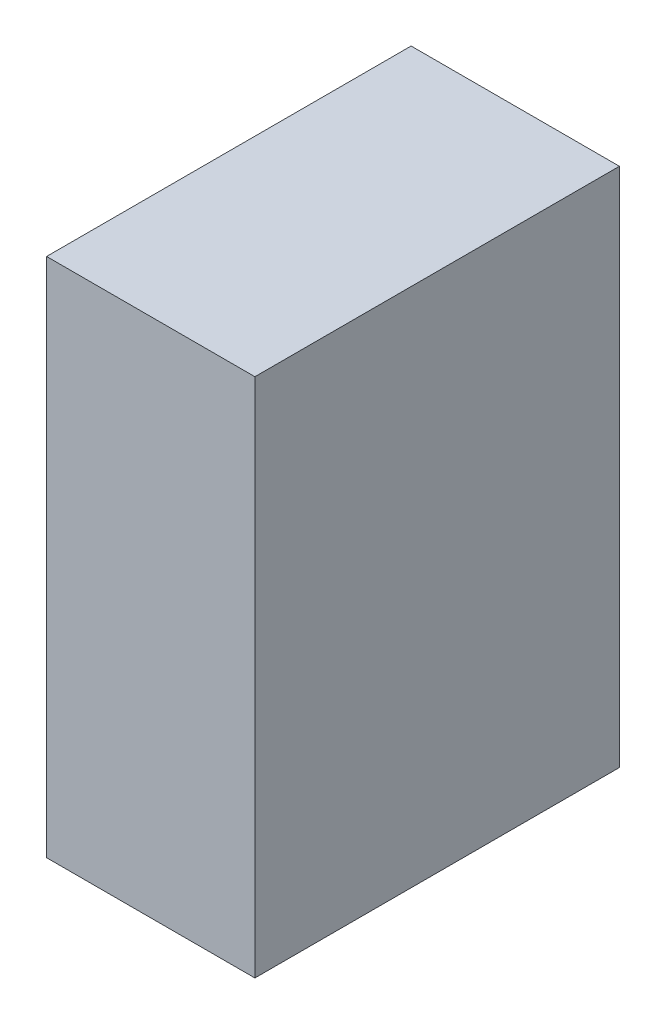
ISO-10303-21;
HEADER;
FILE_DESCRIPTION(('STEP AP214'),'2;1');
FILE_NAME('part.step','',(''),(''),'','','');
FILE_SCHEMA(('AUTOMOTIVE_DESIGN { 1 0 10303 214 1 1 1 1 }'));
ENDSEC;
DATA;
#1=APPLICATION_CONTEXT('core data for automotive mechanical design processes');
#2=APPLICATION_PROTOCOL_DEFINITION('international standard','automotive_design',2000,#1);
#3=PRODUCT_CONTEXT('',#1,'mechanical');
#4=PRODUCT('Part','Part','',(#3));
#5=PRODUCT_RELATED_PRODUCT_CATEGORY('part','',(#4));
#6=PRODUCT_DEFINITION_FORMATION('','',#4);
#7=PRODUCT_DEFINITION_CONTEXT('part definition',#1,'design');
#8=PRODUCT_DEFINITION('design','',#6,#7);
#9=PRODUCT_DEFINITION_SHAPE('','',#8);
#10=(LENGTH_UNIT() NAMED_UNIT(*) SI_UNIT(.MILLI.,.METRE.));
#11=(NAMED_UNIT(*) PLANE_ANGLE_UNIT() SI_UNIT($,.RADIAN.));
#12=(NAMED_UNIT(*) SI_UNIT($,.STERADIAN.) SOLID_ANGLE_UNIT());
#13=UNCERTAINTY_MEASURE_WITH_UNIT(LENGTH_MEASURE(1.E-05),#10,'distance_accuracy_value','');
#14=(GEOMETRIC_REPRESENTATION_CONTEXT(3) GLOBAL_UNCERTAINTY_ASSIGNED_CONTEXT((#13)) GLOBAL_UNIT_ASSIGNED_CONTEXT((#10,
#11,#12)) REPRESENTATION_CONTEXT('',''));
#15=CARTESIAN_POINT('',(0.,0.,0.));
#16=DIRECTION('',(0.,0.,1.));
#17=DIRECTION('',(1.,0.,0.));
#18=AXIS2_PLACEMENT_3D('',#15,#16,#17);
#19=CARTESIAN_POINT('',(0.,0.,0.));
#20=DIRECTION('',(1.,0.,0.));
#21=DIRECTION('',(0.,0.,1.));
#22=AXIS2_PLACEMENT_3D('',#19,#20,#21);
#23=PLANE('',#22);
#24=DIRECTION('',(0.,1.,0.));
#25=VECTOR('',#24,1.);
#26=CARTESIAN_POINT('',(0.,0.,0.35));
#27=LINE('',#26,#25);
#28=CARTESIAN_POINT('',(0.,0.,0.35));
#29=VERTEX_POINT('',#28);
#30=CARTESIAN_POINT('',(0.,0.5,0.35));
#31=VERTEX_POINT('',#30);
#32=EDGE_CURVE('E11',#29,#31,#27,.T.);
#33=ORIENTED_EDGE('',*,*,#32,.T.);
#34=DIRECTION('',(0.,0.,1.));
#35=VECTOR('',#34,1.);
#36=CARTESIAN_POINT('',(0.,0.5,0.));
#37=LINE('',#36,#35);
#38=CARTESIAN_POINT('',(0.,0.5,0.));
#39=VERTEX_POINT('',#38);
#40=EDGE_CURVE('E24',#39,#31,#37,.T.);
#41=ORIENTED_EDGE('',*,*,#40,.F.);
#42=DIRECTION('',(0.,1.,0.));
#43=VECTOR('',#42,1.);
#44=CARTESIAN_POINT('',(0.,0.,0.));
#45=LINE('',#44,#43);
#46=CARTESIAN_POINT('',(0.,0.,0.));
#47=VERTEX_POINT('',#46);
#48=EDGE_CURVE('E86',#47,#39,#45,.T.);
#49=ORIENTED_EDGE('',*,*,#48,.F.);
#50=DIRECTION('',(0.,0.,1.));
#51=VECTOR('',#50,1.);
#52=CARTESIAN_POINT('',(0.,0.,0.));
#53=LINE('',#52,#51);
#54=EDGE_CURVE('E36',#47,#29,#53,.T.);
#55=ORIENTED_EDGE('',*,*,#54,.T.);
#56=EDGE_LOOP('',(#33,#41,#49,#55));
#57=FACE_BOUND('',#56,.T.);
#58=ADVANCED_FACE('F17',(#57),#23,.F.);
#59=CARTESIAN_POINT('',(0.2,0.,0.));
#60=DIRECTION('',(1.,0.,0.));
#61=DIRECTION('',(0.,0.,1.));
#62=AXIS2_PLACEMENT_3D('',#59,#60,#61);
#63=PLANE('',#62);
#64=DIRECTION('',(0.,0.,1.));
#65=VECTOR('',#64,1.);
#66=CARTESIAN_POINT('',(0.2,0.,0.));
#67=LINE('',#66,#65);
#68=CARTESIAN_POINT('',(0.2,0.,0.));
#69=VERTEX_POINT('',#68);
#70=CARTESIAN_POINT('',(0.2,0.,0.35));
#71=VERTEX_POINT('',#70);
#72=EDGE_CURVE('E83',#69,#71,#67,.T.);
#73=ORIENTED_EDGE('',*,*,#72,.F.);
#74=DIRECTION('',(0.,1.,0.));
#75=VECTOR('',#74,1.);
#76=CARTESIAN_POINT('',(0.2,0.,0.));
#77=LINE('',#76,#75);
#78=CARTESIAN_POINT('',(0.2,0.5,0.));
#79=VERTEX_POINT('',#78);
#80=EDGE_CURVE('E63',#69,#79,#77,.T.);
#81=ORIENTED_EDGE('',*,*,#80,.T.);
#82=DIRECTION('',(0.,0.,1.));
#83=VECTOR('',#82,1.);
#84=CARTESIAN_POINT('',(0.2,0.5,0.));
#85=LINE('',#84,#83);
#86=CARTESIAN_POINT('',(0.2,0.5,0.35));
#87=VERTEX_POINT('',#86);
#88=EDGE_CURVE('E57',#79,#87,#85,.T.);
#89=ORIENTED_EDGE('',*,*,#88,.T.);
#90=DIRECTION('',(0.,1.,0.));
#91=VECTOR('',#90,1.);
#92=CARTESIAN_POINT('',(0.2,0.,0.35));
#93=LINE('',#92,#91);
#94=EDGE_CURVE('E60',#71,#87,#93,.T.);
#95=ORIENTED_EDGE('',*,*,#94,.F.);
#96=EDGE_LOOP('',(#73,#81,#89,#95));
#97=FACE_BOUND('',#96,.T.);
#98=ADVANCED_FACE('F59',(#97),#63,.T.);
#99=CARTESIAN_POINT('',(0.,0.,0.));
#100=DIRECTION('',(0.,1.,0.));
#101=DIRECTION('',(0.,0.,1.));
#102=AXIS2_PLACEMENT_3D('',#99,#100,#101);
#103=PLANE('',#102);
#104=ORIENTED_EDGE('',*,*,#72,.T.);
#105=DIRECTION('',(1.,0.,0.));
#106=VECTOR('',#105,1.);
#107=CARTESIAN_POINT('',(0.,0.,0.35));
#108=LINE('',#107,#106);
#109=EDGE_CURVE('E71',#29,#71,#108,.T.);
#110=ORIENTED_EDGE('',*,*,#109,.F.);
#111=ORIENTED_EDGE('',*,*,#54,.F.);
#112=DIRECTION('',(1.,0.,0.));
#113=VECTOR('',#112,1.);
#114=CARTESIAN_POINT('',(0.,0.,0.));
#115=LINE('',#114,#113);
#116=EDGE_CURVE('E76',#47,#69,#115,.T.);
#117=ORIENTED_EDGE('',*,*,#116,.T.);
#118=EDGE_LOOP('',(#104,#110,#111,#117));
#119=FACE_BOUND('',#118,.T.);
#120=ADVANCED_FACE('F91',(#119),#103,.F.);
#121=CARTESIAN_POINT('',(0.,0.5,0.));
#122=DIRECTION('',(0.,1.,0.));
#123=DIRECTION('',(0.,0.,1.));
#124=AXIS2_PLACEMENT_3D('',#121,#122,#123);
#125=PLANE('',#124);
#126=DIRECTION('',(1.,0.,0.));
#127=VECTOR('',#126,1.);
#128=CARTESIAN_POINT('',(0.,0.5,0.));
#129=LINE('',#128,#127);
#130=EDGE_CURVE('E74',#39,#79,#129,.T.);
#131=ORIENTED_EDGE('',*,*,#130,.F.);
#132=ORIENTED_EDGE('',*,*,#40,.T.);
#133=DIRECTION('',(1.,0.,0.));
#134=VECTOR('',#133,1.);
#135=CARTESIAN_POINT('',(0.,0.5,0.35));
#136=LINE('',#135,#134);
#137=EDGE_CURVE('E69',#31,#87,#136,.T.);
#138=ORIENTED_EDGE('',*,*,#137,.T.);
#139=ORIENTED_EDGE('',*,*,#88,.F.);
#140=EDGE_LOOP('',(#131,#132,#138,#139));
#141=FACE_BOUND('',#140,.T.);
#142=ADVANCED_FACE('F73',(#141),#125,.T.);
#143=CARTESIAN_POINT('',(0.,0.,0.));
#144=DIRECTION('',(0.,0.,1.));
#145=DIRECTION('',(1.,0.,0.));
#146=AXIS2_PLACEMENT_3D('',#143,#144,#145);
#147=PLANE('',#146);
#148=ORIENTED_EDGE('',*,*,#130,.T.);
#149=ORIENTED_EDGE('',*,*,#80,.F.);
#150=ORIENTED_EDGE('',*,*,#116,.F.);
#151=ORIENTED_EDGE('',*,*,#48,.T.);
#152=EDGE_LOOP('',(#148,#149,#150,#151));
#153=FACE_BOUND('',#152,.T.);
#154=ADVANCED_FACE('F89',(#153),#147,.F.);
#155=CARTESIAN_POINT('',(0.,0.,0.35));
#156=DIRECTION('',(0.,0.,1.));
#157=DIRECTION('',(1.,0.,0.));
#158=AXIS2_PLACEMENT_3D('',#155,#156,#157);
#159=PLANE('',#158);
#160=ORIENTED_EDGE('',*,*,#32,.F.);
#161=ORIENTED_EDGE('',*,*,#109,.T.);
#162=ORIENTED_EDGE('',*,*,#94,.T.);
#163=ORIENTED_EDGE('',*,*,#137,.F.);
#164=EDGE_LOOP('',(#160,#161,#162,#163));
#165=FACE_BOUND('',#164,.T.);
#166=ADVANCED_FACE('F68',(#165),#159,.T.);
#167=CLOSED_SHELL('',(#58,#98,#120,#142,#154,#166));
#168=MANIFOLD_SOLID_BREP('B1',#167);
#169=ADVANCED_BREP_SHAPE_REPRESENTATION('',(#18,#168),#14);
#170=SHAPE_DEFINITION_REPRESENTATION(#9,#169);
ENDSEC;
END-ISO-10303-21;
